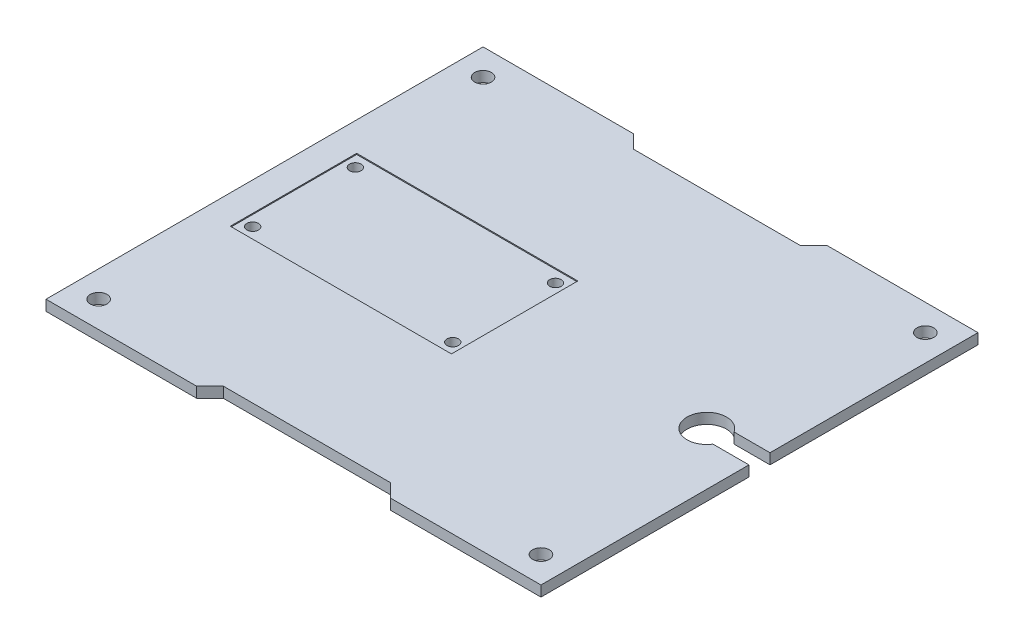
ISO-10303-21;
HEADER;
FILE_DESCRIPTION(('STEP AP214'),'2;1');
FILE_NAME('part.step','',(''),(''),'','','');
FILE_SCHEMA(('AUTOMOTIVE_DESIGN { 1 0 10303 214 1 1 1 1 }'));
ENDSEC;
DATA;
#1=APPLICATION_CONTEXT('core data for automotive mechanical design processes');
#2=APPLICATION_PROTOCOL_DEFINITION('international standard','automotive_design',2000,#1);
#3=PRODUCT_CONTEXT('',#1,'mechanical');
#4=PRODUCT('Part','Part','',(#3));
#5=PRODUCT_RELATED_PRODUCT_CATEGORY('part','',(#4));
#6=PRODUCT_DEFINITION_FORMATION('','',#4);
#7=PRODUCT_DEFINITION_CONTEXT('part definition',#1,'design');
#8=PRODUCT_DEFINITION('design','',#6,#7);
#9=PRODUCT_DEFINITION_SHAPE('','',#8);
#10=(LENGTH_UNIT() NAMED_UNIT(*) SI_UNIT(.MILLI.,.METRE.));
#11=(NAMED_UNIT(*) PLANE_ANGLE_UNIT() SI_UNIT($,.RADIAN.));
#12=(NAMED_UNIT(*) SI_UNIT($,.STERADIAN.) SOLID_ANGLE_UNIT());
#13=UNCERTAINTY_MEASURE_WITH_UNIT(LENGTH_MEASURE(1.E-05),#10,'distance_accuracy_value','');
#14=(GEOMETRIC_REPRESENTATION_CONTEXT(3) GLOBAL_UNCERTAINTY_ASSIGNED_CONTEXT((#13)) GLOBAL_UNIT_ASSIGNED_CONTEXT((#10,
#11,#12)) REPRESENTATION_CONTEXT('',''));
#15=CARTESIAN_POINT('',(0.,0.,0.));
#16=DIRECTION('',(0.,0.,1.));
#17=DIRECTION('',(1.,0.,0.));
#18=AXIS2_PLACEMENT_3D('',#15,#16,#17);
#19=CARTESIAN_POINT('',(-39.5,-8.,-9.74999999999999));
#20=DIRECTION('',(0.,1.,0.));
#21=DIRECTION('',(0.,0.,1.));
#22=AXIS2_PLACEMENT_3D('',#19,#20,#21);
#23=CYLINDRICAL_SURFACE('',#22,1.1);
#24=CARTESIAN_POINT('',(-39.5,0.,-9.74999999999999));
#25=DIRECTION('',(0.,-1.,0.));
#26=DIRECTION('',(0.,0.,-1.));
#27=AXIS2_PLACEMENT_3D('',#24,#25,#26);
#28=CIRCLE('',#27,1.1);
#29=CARTESIAN_POINT('',(-39.5,0.,-10.85));
#30=VERTEX_POINT('',#29);
#31=EDGE_CURVE('E310',#30,#30,#28,.T.);
#32=ORIENTED_EDGE('',*,*,#31,.T.);
#33=EDGE_LOOP('',(#32));
#34=FACE_BOUND('',#33,.T.);
#35=CARTESIAN_POINT('',(-39.5,1.8,-9.74999999999999));
#36=DIRECTION('',(0.,1.,0.));
#37=DIRECTION('',(0.,0.,1.));
#38=AXIS2_PLACEMENT_3D('',#35,#36,#37);
#39=CIRCLE('',#38,1.1);
#40=CARTESIAN_POINT('',(-39.5,1.8,-8.65));
#41=VERTEX_POINT('',#40);
#42=EDGE_CURVE('E238',#41,#41,#39,.F.);
#43=ORIENTED_EDGE('',*,*,#42,.F.);
#44=EDGE_LOOP('',(#43));
#45=FACE_BOUND('',#44,.T.);
#46=ADVANCED_FACE('F41',(#34,#45),#23,.F.);
#47=CARTESIAN_POINT('',(-1.5,-8.,-9.74999999999999));
#48=DIRECTION('',(0.,1.,0.));
#49=DIRECTION('',(0.,0.,1.));
#50=AXIS2_PLACEMENT_3D('',#47,#48,#49);
#51=CYLINDRICAL_SURFACE('',#50,1.1);
#52=CARTESIAN_POINT('',(-1.5,0.,-9.74999999999999));
#53=DIRECTION('',(0.,-1.,0.));
#54=DIRECTION('',(0.,0.,-1.));
#55=AXIS2_PLACEMENT_3D('',#52,#53,#54);
#56=CIRCLE('',#55,1.1);
#57=CARTESIAN_POINT('',(-1.5,0.,-10.85));
#58=VERTEX_POINT('',#57);
#59=EDGE_CURVE('E423',#58,#58,#56,.T.);
#60=ORIENTED_EDGE('',*,*,#59,.T.);
#61=EDGE_LOOP('',(#60));
#62=FACE_BOUND('',#61,.T.);
#63=CARTESIAN_POINT('',(-1.5,1.8,-9.74999999999999));
#64=DIRECTION('',(0.,1.,0.));
#65=DIRECTION('',(0.,0.,1.));
#66=AXIS2_PLACEMENT_3D('',#63,#64,#65);
#67=CIRCLE('',#66,1.1);
#68=CARTESIAN_POINT('',(-1.5,1.8,-8.65));
#69=VERTEX_POINT('',#68);
#70=EDGE_CURVE('E234',#69,#69,#67,.F.);
#71=ORIENTED_EDGE('',*,*,#70,.F.);
#72=EDGE_LOOP('',(#71));
#73=FACE_BOUND('',#72,.T.);
#74=ADVANCED_FACE('F480',(#62,#73),#51,.F.);
#75=CARTESIAN_POINT('',(-1.5,-8.,9.75000000000001));
#76=DIRECTION('',(0.,1.,0.));
#77=DIRECTION('',(0.,0.,1.));
#78=AXIS2_PLACEMENT_3D('',#75,#76,#77);
#79=CYLINDRICAL_SURFACE('',#78,1.1);
#80=CARTESIAN_POINT('',(-1.5,0.,9.75000000000001));
#81=DIRECTION('',(0.,-1.,0.));
#82=DIRECTION('',(0.,0.,-1.));
#83=AXIS2_PLACEMENT_3D('',#80,#81,#82);
#84=CIRCLE('',#83,1.1);
#85=CARTESIAN_POINT('',(-1.5,0.,8.65000000000001));
#86=VERTEX_POINT('',#85);
#87=EDGE_CURVE('E431',#86,#86,#84,.T.);
#88=ORIENTED_EDGE('',*,*,#87,.T.);
#89=EDGE_LOOP('',(#88));
#90=FACE_BOUND('',#89,.T.);
#91=CARTESIAN_POINT('',(-1.5,1.8,9.75000000000001));
#92=DIRECTION('',(0.,1.,0.));
#93=DIRECTION('',(0.,0.,1.));
#94=AXIS2_PLACEMENT_3D('',#91,#92,#93);
#95=CIRCLE('',#94,1.1);
#96=CARTESIAN_POINT('',(-1.5,1.8,10.85));
#97=VERTEX_POINT('',#96);
#98=EDGE_CURVE('E230',#97,#97,#95,.F.);
#99=ORIENTED_EDGE('',*,*,#98,.F.);
#100=EDGE_LOOP('',(#99));
#101=FACE_BOUND('',#100,.T.);
#102=ADVANCED_FACE('F485',(#90,#101),#79,.F.);
#103=CARTESIAN_POINT('',(-39.5,-8.,9.75000000000001));
#104=DIRECTION('',(0.,1.,0.));
#105=DIRECTION('',(0.,0.,1.));
#106=AXIS2_PLACEMENT_3D('',#103,#104,#105);
#107=CYLINDRICAL_SURFACE('',#106,1.1);
#108=CARTESIAN_POINT('',(-39.5,0.,9.75000000000001));
#109=DIRECTION('',(0.,-1.,0.));
#110=DIRECTION('',(0.,0.,-1.));
#111=AXIS2_PLACEMENT_3D('',#108,#109,#110);
#112=CIRCLE('',#111,1.1);
#113=CARTESIAN_POINT('',(-39.5,0.,8.65000000000001));
#114=VERTEX_POINT('',#113);
#115=EDGE_CURVE('E320',#114,#114,#112,.T.);
#116=ORIENTED_EDGE('',*,*,#115,.T.);
#117=EDGE_LOOP('',(#116));
#118=FACE_BOUND('',#117,.T.);
#119=CARTESIAN_POINT('',(-39.5,1.8,9.75000000000001));
#120=DIRECTION('',(0.,1.,0.));
#121=DIRECTION('',(0.,0.,1.));
#122=AXIS2_PLACEMENT_3D('',#119,#120,#121);
#123=CIRCLE('',#122,1.1);
#124=CARTESIAN_POINT('',(-39.5,1.8,10.85));
#125=VERTEX_POINT('',#124);
#126=EDGE_CURVE('E45',#125,#125,#123,.F.);
#127=ORIENTED_EDGE('',*,*,#126,.F.);
#128=EDGE_LOOP('',(#127));
#129=FACE_BOUND('',#128,.T.);
#130=ADVANCED_FACE('F439',(#118,#129),#107,.F.);
#131=CARTESIAN_POINT('',(47.,2.,41.5));
#132=DIRECTION('',(-1.,0.,0.));
#133=DIRECTION('',(0.,0.,1.));
#134=AXIS2_PLACEMENT_3D('',#131,#132,#133);
#135=PLANE('',#134);
#136=DIRECTION('',(0.,0.,-1.));
#137=VECTOR('',#136,1.);
#138=CARTESIAN_POINT('',(47.,2.,41.5));
#139=LINE('',#138,#137);
#140=CARTESIAN_POINT('',(47.,2.,-2.));
#141=VERTEX_POINT('',#140);
#142=CARTESIAN_POINT('',(47.,2.,-41.5));
#143=VERTEX_POINT('',#142);
#144=EDGE_CURVE('E350',#141,#143,#139,.T.);
#145=ORIENTED_EDGE('',*,*,#144,.F.);
#146=DIRECTION('',(0.,-1.,0.));
#147=VECTOR('',#146,1.);
#148=CARTESIAN_POINT('',(47.,2.,-1.99999999999999));
#149=LINE('',#148,#147);
#150=CARTESIAN_POINT('',(47.,0.,-2.));
#151=VERTEX_POINT('',#150);
#152=EDGE_CURVE('E415',#141,#151,#149,.T.);
#153=ORIENTED_EDGE('',*,*,#152,.T.);
#154=DIRECTION('',(0.,0.,-1.));
#155=VECTOR('',#154,1.);
#156=CARTESIAN_POINT('',(47.,0.,41.5));
#157=LINE('',#156,#155);
#158=CARTESIAN_POINT('',(47.,0.,-41.5));
#159=VERTEX_POINT('',#158);
#160=EDGE_CURVE('E341',#151,#159,#157,.T.);
#161=ORIENTED_EDGE('',*,*,#160,.T.);
#162=DIRECTION('',(0.,-1.,0.));
#163=VECTOR('',#162,1.);
#164=CARTESIAN_POINT('',(47.,2.,-41.5));
#165=LINE('',#164,#163);
#166=EDGE_CURVE('E392',#143,#159,#165,.T.);
#167=ORIENTED_EDGE('',*,*,#166,.F.);
#168=EDGE_LOOP('',(#145,#153,#161,#167));
#169=FACE_BOUND('',#168,.T.);
#170=ADVANCED_FACE('F507',(#169),#135,.F.);
#171=CARTESIAN_POINT('',(-47.,2.,-41.5));
#172=DIRECTION('',(0.,0.,1.));
#173=DIRECTION('',(1.,0.,0.));
#174=AXIS2_PLACEMENT_3D('',#171,#172,#173);
#175=PLANE('',#174);
#176=DIRECTION('',(-1.,0.,0.));
#177=VECTOR('',#176,1.);
#178=CARTESIAN_POINT('',(-47.,0.,-41.5));
#179=LINE('',#178,#177);
#180=CARTESIAN_POINT('',(18.415,0.,-41.5));
#181=VERTEX_POINT('',#180);
#182=EDGE_CURVE('E369',#159,#181,#179,.T.);
#183=ORIENTED_EDGE('',*,*,#182,.T.);
#184=DIRECTION('',(0.,1.,0.));
#185=VECTOR('',#184,1.);
#186=CARTESIAN_POINT('',(18.415,2.,-41.5));
#187=LINE('',#186,#185);
#188=CARTESIAN_POINT('',(18.415,2.,-41.5));
#189=VERTEX_POINT('',#188);
#190=EDGE_CURVE('E408',#181,#189,#187,.T.);
#191=ORIENTED_EDGE('',*,*,#190,.T.);
#192=DIRECTION('',(-1.,0.,0.));
#193=VECTOR('',#192,1.);
#194=CARTESIAN_POINT('',(-47.,2.,-41.5));
#195=LINE('',#194,#193);
#196=EDGE_CURVE('E351',#143,#189,#195,.T.);
#197=ORIENTED_EDGE('',*,*,#196,.F.);
#198=ORIENTED_EDGE('',*,*,#166,.T.);
#199=EDGE_LOOP('',(#183,#191,#197,#198));
#200=FACE_BOUND('',#199,.T.);
#201=ADVANCED_FACE('F642',(#200),#175,.F.);
#202=CARTESIAN_POINT('',(-47.,2.,41.5));
#203=DIRECTION('',(0.,0.,-1.));
#204=DIRECTION('',(-1.,0.,0.));
#205=AXIS2_PLACEMENT_3D('',#202,#203,#204);
#206=PLANE('',#205);
#207=DIRECTION('',(1.,0.,0.));
#208=VECTOR('',#207,1.);
#209=CARTESIAN_POINT('',(-47.,0.,41.5));
#210=LINE('',#209,#208);
#211=CARTESIAN_POINT('',(-47.,0.,41.5));
#212=VERTEX_POINT('',#211);
#213=CARTESIAN_POINT('',(-18.415,0.,41.5));
#214=VERTEX_POINT('',#213);
#215=EDGE_CURVE('E377',#212,#214,#210,.T.);
#216=ORIENTED_EDGE('',*,*,#215,.T.);
#217=DIRECTION('',(0.,1.,0.));
#218=VECTOR('',#217,1.);
#219=CARTESIAN_POINT('',(-18.415,2.,41.5));
#220=LINE('',#219,#218);
#221=CARTESIAN_POINT('',(-18.415,2.,41.5));
#222=VERTEX_POINT('',#221);
#223=EDGE_CURVE('E400',#214,#222,#220,.T.);
#224=ORIENTED_EDGE('',*,*,#223,.T.);
#225=DIRECTION('',(1.,0.,0.));
#226=VECTOR('',#225,1.);
#227=CARTESIAN_POINT('',(-47.,2.,41.5));
#228=LINE('',#227,#226);
#229=CARTESIAN_POINT('',(-47.,2.,41.5));
#230=VERTEX_POINT('',#229);
#231=EDGE_CURVE('E359',#230,#222,#228,.T.);
#232=ORIENTED_EDGE('',*,*,#231,.F.);
#233=DIRECTION('',(0.,-1.,0.));
#234=VECTOR('',#233,1.);
#235=CARTESIAN_POINT('',(-47.,2.,41.5));
#236=LINE('',#235,#234);
#237=EDGE_CURVE('E384',#230,#212,#236,.T.);
#238=ORIENTED_EDGE('',*,*,#237,.T.);
#239=EDGE_LOOP('',(#216,#224,#232,#238));
#240=FACE_BOUND('',#239,.T.);
#241=ADVANCED_FACE('F650',(#240),#206,.F.);
#242=CARTESIAN_POINT('',(0.,2.,0.));
#243=DIRECTION('',(0.,-1.,0.));
#244=DIRECTION('',(0.,0.,-1.));
#245=AXIS2_PLACEMENT_3D('',#242,#243,#244);
#246=PLANE('',#245);
#247=DIRECTION('',(1.,0.,0.));
#248=VECTOR('',#247,1.);
#249=CARTESIAN_POINT('',(-41.5,2.,12.));
#250=LINE('',#249,#248);
#251=CARTESIAN_POINT('',(-41.5,2.,12.));
#252=VERTEX_POINT('',#251);
#253=CARTESIAN_POINT('',(0.499999999999997,2.,12.));
#254=VERTEX_POINT('',#253);
#255=EDGE_CURVE('E216',#252,#254,#250,.T.);
#256=ORIENTED_EDGE('',*,*,#255,.F.);
#257=DIRECTION('',(0.,0.,1.));
#258=VECTOR('',#257,1.);
#259=CARTESIAN_POINT('',(-41.5,2.,-12.));
#260=LINE('',#259,#258);
#261=CARTESIAN_POINT('',(-41.5,2.,-12.));
#262=VERTEX_POINT('',#261);
#263=EDGE_CURVE('E58',#262,#252,#260,.T.);
#264=ORIENTED_EDGE('',*,*,#263,.F.);
#265=DIRECTION('',(-1.,0.,0.));
#266=VECTOR('',#265,1.);
#267=CARTESIAN_POINT('',(-41.5,2.,-12.));
#268=LINE('',#267,#266);
#269=CARTESIAN_POINT('',(0.499999999999997,2.,-12.));
#270=VERTEX_POINT('',#269);
#271=EDGE_CURVE('E203',#270,#262,#268,.T.);
#272=ORIENTED_EDGE('',*,*,#271,.F.);
#273=DIRECTION('',(0.,0.,-1.));
#274=VECTOR('',#273,1.);
#275=CARTESIAN_POINT('',(0.499999999999997,2.,-12.));
#276=LINE('',#275,#274);
#277=EDGE_CURVE('E207',#254,#270,#276,.T.);
#278=ORIENTED_EDGE('',*,*,#277,.F.);
#279=EDGE_LOOP('',(#256,#264,#272,#278));
#280=FACE_BOUND('',#279,.T.);
#281=CARTESIAN_POINT('',(37.,2.,0.));
#282=DIRECTION('',(0.,1.,0.));
#283=DIRECTION('',(0.,0.,1.));
#284=AXIS2_PLACEMENT_3D('',#281,#282,#283);
#285=CIRCLE('',#284,3.75);
#286=CARTESIAN_POINT('',(40.1721443851124,2.,-2.));
#287=VERTEX_POINT('',#286);
#288=CARTESIAN_POINT('',(40.1721443851124,2.,2.));
#289=VERTEX_POINT('',#288);
#290=EDGE_CURVE('E259',#287,#289,#285,.T.);
#291=ORIENTED_EDGE('',*,*,#290,.F.);
#292=DIRECTION('',(-1.,0.,0.));
#293=VECTOR('',#292,1.);
#294=CARTESIAN_POINT('',(40.1721443851124,2.,-2.));
#295=LINE('',#294,#293);
#296=EDGE_CURVE('E282',#141,#287,#295,.T.);
#297=ORIENTED_EDGE('',*,*,#296,.F.);
#298=ORIENTED_EDGE('',*,*,#144,.T.);
#299=ORIENTED_EDGE('',*,*,#196,.T.);
#300=DIRECTION('',(0.707106781186549,0.,-0.707106781186546));
#301=VECTOR('',#300,1.);
#302=CARTESIAN_POINT('',(15.875,2.,-38.96));
#303=LINE('',#302,#301);
#304=CARTESIAN_POINT('',(15.875,2.,-38.96));
#305=VERTEX_POINT('',#304);
#306=EDGE_CURVE('E252',#305,#189,#303,.T.);
#307=ORIENTED_EDGE('',*,*,#306,.F.);
#308=DIRECTION('',(1.,0.,0.));
#309=VECTOR('',#308,1.);
#310=CARTESIAN_POINT('',(-15.875,2.,-38.96));
#311=LINE('',#310,#309);
#312=CARTESIAN_POINT('',(-15.875,2.,-38.96));
#313=VERTEX_POINT('',#312);
#314=EDGE_CURVE('E247',#313,#305,#311,.T.);
#315=ORIENTED_EDGE('',*,*,#314,.F.);
#316=DIRECTION('',(0.70710678118655,0.,0.707106781186545));
#317=VECTOR('',#316,1.);
#318=CARTESIAN_POINT('',(-18.415,2.,-41.5));
#319=LINE('',#318,#317);
#320=CARTESIAN_POINT('',(-18.415,2.,-41.5));
#321=VERTEX_POINT('',#320);
#322=EDGE_CURVE('E243',#321,#313,#319,.T.);
#323=ORIENTED_EDGE('',*,*,#322,.F.);
#324=CARTESIAN_POINT('',(-47.,2.,-41.5));
#325=VERTEX_POINT('',#324);
#326=EDGE_CURVE('E349',#321,#325,#195,.T.);
#327=ORIENTED_EDGE('',*,*,#326,.T.);
#328=DIRECTION('',(0.,0.,1.));
#329=VECTOR('',#328,1.);
#330=CARTESIAN_POINT('',(-47.,2.,41.5));
#331=LINE('',#330,#329);
#332=EDGE_CURVE('E355',#325,#230,#331,.T.);
#333=ORIENTED_EDGE('',*,*,#332,.T.);
#334=ORIENTED_EDGE('',*,*,#231,.T.);
#335=DIRECTION('',(-0.707106781186548,0.,0.707106781186548));
#336=VECTOR('',#335,1.);
#337=CARTESIAN_POINT('',(-18.415,2.,41.5));
#338=LINE('',#337,#336);
#339=CARTESIAN_POINT('',(-15.875,2.,38.96));
#340=VERTEX_POINT('',#339);
#341=EDGE_CURVE('E269',#340,#222,#338,.T.);
#342=ORIENTED_EDGE('',*,*,#341,.F.);
#343=DIRECTION('',(-1.,0.,0.));
#344=VECTOR('',#343,1.);
#345=CARTESIAN_POINT('',(-15.875,2.,38.96));
#346=LINE('',#345,#344);
#347=CARTESIAN_POINT('',(15.875,2.,38.96));
#348=VERTEX_POINT('',#347);
#349=EDGE_CURVE('E265',#348,#340,#346,.T.);
#350=ORIENTED_EDGE('',*,*,#349,.F.);
#351=DIRECTION('',(-0.707106781186548,0.,-0.707106781186548));
#352=VECTOR('',#351,1.);
#353=CARTESIAN_POINT('',(15.875,2.,38.96));
#354=LINE('',#353,#352);
#355=CARTESIAN_POINT('',(18.415,2.,41.5));
#356=VERTEX_POINT('',#355);
#357=EDGE_CURVE('E242',#356,#348,#354,.T.);
#358=ORIENTED_EDGE('',*,*,#357,.F.);
#359=CARTESIAN_POINT('',(47.,2.,41.5));
#360=VERTEX_POINT('',#359);
#361=EDGE_CURVE('E358',#356,#360,#228,.T.);
#362=ORIENTED_EDGE('',*,*,#361,.T.);
#363=CARTESIAN_POINT('',(47.,2.,2.));
#364=VERTEX_POINT('',#363);
#365=EDGE_CURVE('E345',#360,#364,#139,.T.);
#366=ORIENTED_EDGE('',*,*,#365,.T.);
#367=DIRECTION('',(1.,0.,0.));
#368=VECTOR('',#367,1.);
#369=CARTESIAN_POINT('',(40.1721443851124,2.,2.));
#370=LINE('',#369,#368);
#371=EDGE_CURVE('E66',#289,#364,#370,.T.);
#372=ORIENTED_EDGE('',*,*,#371,.F.);
#373=EDGE_LOOP('',(#291,#297,#298,#299,#307,#315,#323,#327,#333,#334,#342,#350,#358,#362,#366,#372));
#374=FACE_BOUND('',#373,.T.);
#375=CARTESIAN_POINT('',(-42.,2.,-36.5));
#376=DIRECTION('',(0.,1.,0.));
#377=DIRECTION('',(0.,0.,1.));
#378=AXIS2_PLACEMENT_3D('',#375,#376,#377);
#379=CIRCLE('',#378,1.5875);
#380=CARTESIAN_POINT('',(-42.,2.,-34.9125));
#381=VERTEX_POINT('',#380);
#382=EDGE_CURVE('E337',#381,#381,#379,.T.);
#383=ORIENTED_EDGE('',*,*,#382,.F.);
#384=EDGE_LOOP('',(#383));
#385=FACE_BOUND('',#384,.T.);
#386=CARTESIAN_POINT('',(42.,2.,-36.5));
#387=DIRECTION('',(0.,1.,0.));
#388=DIRECTION('',(0.,0.,1.));
#389=AXIS2_PLACEMENT_3D('',#386,#387,#388);
#390=CIRCLE('',#389,1.5875);
#391=CARTESIAN_POINT('',(42.,2.,-34.9125));
#392=VERTEX_POINT('',#391);
#393=EDGE_CURVE('E329',#392,#392,#390,.T.);
#394=ORIENTED_EDGE('',*,*,#393,.F.);
#395=EDGE_LOOP('',(#394));
#396=FACE_BOUND('',#395,.T.);
#397=CARTESIAN_POINT('',(42.,2.,36.5));
#398=DIRECTION('',(0.,1.,0.));
#399=DIRECTION('',(0.,0.,1.));
#400=AXIS2_PLACEMENT_3D('',#397,#398,#399);
#401=CIRCLE('',#400,1.5875);
#402=CARTESIAN_POINT('',(42.,2.,38.0875));
#403=VERTEX_POINT('',#402);
#404=EDGE_CURVE('E321',#403,#403,#401,.T.);
#405=ORIENTED_EDGE('',*,*,#404,.F.);
#406=EDGE_LOOP('',(#405));
#407=FACE_BOUND('',#406,.T.);
#408=CARTESIAN_POINT('',(-42.,2.,36.5));
#409=DIRECTION('',(0.,1.,0.));
#410=DIRECTION('',(0.,0.,1.));
#411=AXIS2_PLACEMENT_3D('',#408,#409,#410);
#412=CIRCLE('',#411,1.5875);
#413=CARTESIAN_POINT('',(-42.,2.,38.0875));
#414=VERTEX_POINT('',#413);
#415=EDGE_CURVE('E311',#414,#414,#412,.T.);
#416=ORIENTED_EDGE('',*,*,#415,.F.);
#417=EDGE_LOOP('',(#416));
#418=FACE_BOUND('',#417,.T.);
#419=ADVANCED_FACE('F445',(#280,#374,#385,#396,#407,#418),#246,.F.);
#420=CARTESIAN_POINT('',(0.,0.,0.));
#421=DIRECTION('',(0.,-1.,0.));
#422=DIRECTION('',(0.,0.,-1.));
#423=AXIS2_PLACEMENT_3D('',#420,#421,#422);
#424=PLANE('',#423);
#425=DIRECTION('',(1.,0.,0.));
#426=VECTOR('',#425,1.);
#427=CARTESIAN_POINT('',(0.,0.,-2.));
#428=LINE('',#427,#426);
#429=CARTESIAN_POINT('',(40.1721443851124,0.,-2.));
#430=VERTEX_POINT('',#429);
#431=EDGE_CURVE('E307',#430,#151,#428,.T.);
#432=ORIENTED_EDGE('',*,*,#431,.F.);
#433=CARTESIAN_POINT('',(37.,0.,0.));
#434=DIRECTION('',(0.,-1.,0.));
#435=DIRECTION('',(0.,0.,-1.));
#436=AXIS2_PLACEMENT_3D('',#433,#434,#435);
#437=CIRCLE('',#436,3.75);
#438=CARTESIAN_POINT('',(40.1721443851124,0.,2.));
#439=VERTEX_POINT('',#438);
#440=EDGE_CURVE('E11',#439,#430,#437,.T.);
#441=ORIENTED_EDGE('',*,*,#440,.F.);
#442=DIRECTION('',(-1.,0.,0.));
#443=VECTOR('',#442,1.);
#444=CARTESIAN_POINT('',(0.,0.,2.00000000000001));
#445=LINE('',#444,#443);
#446=CARTESIAN_POINT('',(47.,0.,2.));
#447=VERTEX_POINT('',#446);
#448=EDGE_CURVE('E304',#447,#439,#445,.T.);
#449=ORIENTED_EDGE('',*,*,#448,.F.);
#450=CARTESIAN_POINT('',(47.,0.,41.5));
#451=VERTEX_POINT('',#450);
#452=EDGE_CURVE('E364',#451,#447,#157,.T.);
#453=ORIENTED_EDGE('',*,*,#452,.F.);
#454=CARTESIAN_POINT('',(18.415,0.,41.5));
#455=VERTEX_POINT('',#454);
#456=EDGE_CURVE('E376',#455,#451,#210,.T.);
#457=ORIENTED_EDGE('',*,*,#456,.F.);
#458=DIRECTION('',(0.707106781186548,0.,0.707106781186548));
#459=VECTOR('',#458,1.);
#460=CARTESIAN_POINT('',(-11.5425,0.,11.5425));
#461=LINE('',#460,#459);
#462=CARTESIAN_POINT('',(15.875,0.,38.96));
#463=VERTEX_POINT('',#462);
#464=EDGE_CURVE('E290',#463,#455,#461,.T.);
#465=ORIENTED_EDGE('',*,*,#464,.F.);
#466=DIRECTION('',(1.,0.,0.));
#467=VECTOR('',#466,1.);
#468=CARTESIAN_POINT('',(0.,0.,38.96));
#469=LINE('',#468,#467);
#470=CARTESIAN_POINT('',(-15.875,0.,38.96));
#471=VERTEX_POINT('',#470);
#472=EDGE_CURVE('E419',#471,#463,#469,.T.);
#473=ORIENTED_EDGE('',*,*,#472,.F.);
#474=DIRECTION('',(0.707106781186548,0.,-0.707106781186548));
#475=VECTOR('',#474,1.);
#476=CARTESIAN_POINT('',(11.5425,0.,11.5425));
#477=LINE('',#476,#475);
#478=EDGE_CURVE('E295',#214,#471,#477,.T.);
#479=ORIENTED_EDGE('',*,*,#478,.F.);
#480=ORIENTED_EDGE('',*,*,#215,.F.);
#481=DIRECTION('',(0.,0.,1.));
#482=VECTOR('',#481,1.);
#483=CARTESIAN_POINT('',(-47.,0.,41.5));
#484=LINE('',#483,#482);
#485=CARTESIAN_POINT('',(-47.,0.,-41.5));
#486=VERTEX_POINT('',#485);
#487=EDGE_CURVE('E373',#486,#212,#484,.T.);
#488=ORIENTED_EDGE('',*,*,#487,.F.);
#489=CARTESIAN_POINT('',(-18.415,0.,-41.5));
#490=VERTEX_POINT('',#489);
#491=EDGE_CURVE('E368',#490,#486,#179,.T.);
#492=ORIENTED_EDGE('',*,*,#491,.F.);
#493=DIRECTION('',(-0.70710678118655,0.,-0.707106781186545));
#494=VECTOR('',#493,1.);
#495=CARTESIAN_POINT('',(11.5425000000001,0.,-11.5425000000001));
#496=LINE('',#495,#494);
#497=CARTESIAN_POINT('',(-15.875,0.,-38.96));
#498=VERTEX_POINT('',#497);
#499=EDGE_CURVE('E298',#498,#490,#496,.T.);
#500=ORIENTED_EDGE('',*,*,#499,.F.);
#501=DIRECTION('',(-1.,0.,0.));
#502=VECTOR('',#501,1.);
#503=CARTESIAN_POINT('',(0.,0.,-38.96));
#504=LINE('',#503,#502);
#505=CARTESIAN_POINT('',(15.875,0.,-38.96));
#506=VERTEX_POINT('',#505);
#507=EDGE_CURVE('E51',#506,#498,#504,.T.);
#508=ORIENTED_EDGE('',*,*,#507,.F.);
#509=DIRECTION('',(-0.707106781186549,0.,0.707106781186546));
#510=VECTOR('',#509,1.);
#511=CARTESIAN_POINT('',(-11.5425,0.,-11.5425000000001));
#512=LINE('',#511,#510);
#513=EDGE_CURVE('E301',#181,#506,#512,.T.);
#514=ORIENTED_EDGE('',*,*,#513,.F.);
#515=ORIENTED_EDGE('',*,*,#182,.F.);
#516=ORIENTED_EDGE('',*,*,#160,.F.);
#517=EDGE_LOOP('',(#432,#441,#449,#453,#457,#465,#473,#479,#480,#488,#492,#500,#508,#514,#515,#516));
#518=FACE_BOUND('',#517,.T.);
#519=ORIENTED_EDGE('',*,*,#115,.F.);
#520=EDGE_LOOP('',(#519));
#521=FACE_BOUND('',#520,.T.);
#522=ORIENTED_EDGE('',*,*,#87,.F.);
#523=EDGE_LOOP('',(#522));
#524=FACE_BOUND('',#523,.T.);
#525=ORIENTED_EDGE('',*,*,#59,.F.);
#526=EDGE_LOOP('',(#525));
#527=FACE_BOUND('',#526,.T.);
#528=ORIENTED_EDGE('',*,*,#31,.F.);
#529=EDGE_LOOP('',(#528));
#530=FACE_BOUND('',#529,.T.);
#531=CARTESIAN_POINT('',(42.,0.,36.5));
#532=DIRECTION('',(0.,1.,0.));
#533=DIRECTION('',(0.,0.,1.));
#534=AXIS2_PLACEMENT_3D('',#531,#532,#533);
#535=CIRCLE('',#534,1.5875);
#536=CARTESIAN_POINT('',(42.,0.,38.0875));
#537=VERTEX_POINT('',#536);
#538=EDGE_CURVE('E315',#537,#537,#535,.T.);
#539=ORIENTED_EDGE('',*,*,#538,.T.);
#540=EDGE_LOOP('',(#539));
#541=FACE_BOUND('',#540,.T.);
#542=CARTESIAN_POINT('',(-42.,0.,-36.5));
#543=DIRECTION('',(0.,1.,0.));
#544=DIRECTION('',(0.,0.,1.));
#545=AXIS2_PLACEMENT_3D('',#542,#543,#544);
#546=CIRCLE('',#545,1.5875);
#547=CARTESIAN_POINT('',(-42.,0.,-34.9125));
#548=VERTEX_POINT('',#547);
#549=EDGE_CURVE('E333',#548,#548,#546,.T.);
#550=ORIENTED_EDGE('',*,*,#549,.T.);
#551=EDGE_LOOP('',(#550));
#552=FACE_BOUND('',#551,.T.);
#553=CARTESIAN_POINT('',(42.,0.,-36.5));
#554=DIRECTION('',(0.,1.,0.));
#555=DIRECTION('',(0.,0.,1.));
#556=AXIS2_PLACEMENT_3D('',#553,#554,#555);
#557=CIRCLE('',#556,1.5875);
#558=CARTESIAN_POINT('',(42.,0.,-34.9125));
#559=VERTEX_POINT('',#558);
#560=EDGE_CURVE('E325',#559,#559,#557,.T.);
#561=ORIENTED_EDGE('',*,*,#560,.T.);
#562=EDGE_LOOP('',(#561));
#563=FACE_BOUND('',#562,.T.);
#564=CARTESIAN_POINT('',(-42.,0.,36.5));
#565=DIRECTION('',(0.,1.,0.));
#566=DIRECTION('',(0.,0.,1.));
#567=AXIS2_PLACEMENT_3D('',#564,#565,#566);
#568=CIRCLE('',#567,1.5875);
#569=CARTESIAN_POINT('',(-42.,0.,38.0875));
#570=VERTEX_POINT('',#569);
#571=EDGE_CURVE('E316',#570,#570,#568,.T.);
#572=ORIENTED_EDGE('',*,*,#571,.T.);
#573=EDGE_LOOP('',(#572));
#574=FACE_BOUND('',#573,.T.);
#575=ADVANCED_FACE('F442',(#518,#521,#524,#527,#530,#541,#552,#563,#574),#424,.T.);
#576=ORIENTED_EDGE('',*,*,#452,.T.);
#577=DIRECTION('',(0.,1.,0.));
#578=VECTOR('',#577,1.);
#579=CARTESIAN_POINT('',(47.,2.,2.));
#580=LINE('',#579,#578);
#581=EDGE_CURVE('E412',#447,#364,#580,.T.);
#582=ORIENTED_EDGE('',*,*,#581,.T.);
#583=ORIENTED_EDGE('',*,*,#365,.F.);
#584=DIRECTION('',(0.,-1.,0.));
#585=VECTOR('',#584,1.);
#586=CARTESIAN_POINT('',(47.,2.,41.5));
#587=LINE('',#586,#585);
#588=EDGE_CURVE('E363',#360,#451,#587,.T.);
#589=ORIENTED_EDGE('',*,*,#588,.T.);
#590=EDGE_LOOP('',(#576,#582,#583,#589));
#591=FACE_BOUND('',#590,.T.);
#592=ADVANCED_FACE('F43',(#591),#135,.F.);
#593=ORIENTED_EDGE('',*,*,#326,.F.);
#594=DIRECTION('',(0.,-1.,0.));
#595=VECTOR('',#594,1.);
#596=CARTESIAN_POINT('',(-18.415,2.,-41.5));
#597=LINE('',#596,#595);
#598=EDGE_CURVE('E404',#321,#490,#597,.T.);
#599=ORIENTED_EDGE('',*,*,#598,.T.);
#600=ORIENTED_EDGE('',*,*,#491,.T.);
#601=DIRECTION('',(0.,-1.,0.));
#602=VECTOR('',#601,1.);
#603=CARTESIAN_POINT('',(-47.,2.,-41.5));
#604=LINE('',#603,#602);
#605=EDGE_CURVE('E388',#325,#486,#604,.T.);
#606=ORIENTED_EDGE('',*,*,#605,.F.);
#607=EDGE_LOOP('',(#593,#599,#600,#606));
#608=FACE_BOUND('',#607,.T.);
#609=ADVANCED_FACE('F652',(#608),#175,.F.);
#610=CARTESIAN_POINT('',(-47.,2.,41.5));
#611=DIRECTION('',(1.,0.,0.));
#612=DIRECTION('',(0.,0.,-1.));
#613=AXIS2_PLACEMENT_3D('',#610,#611,#612);
#614=PLANE('',#613);
#615=ORIENTED_EDGE('',*,*,#487,.T.);
#616=ORIENTED_EDGE('',*,*,#237,.F.);
#617=ORIENTED_EDGE('',*,*,#332,.F.);
#618=ORIENTED_EDGE('',*,*,#605,.T.);
#619=EDGE_LOOP('',(#615,#616,#617,#618));
#620=FACE_BOUND('',#619,.T.);
#621=ADVANCED_FACE('F695',(#620),#614,.F.);
#622=ORIENTED_EDGE('',*,*,#361,.F.);
#623=DIRECTION('',(0.,-1.,0.));
#624=VECTOR('',#623,1.);
#625=CARTESIAN_POINT('',(18.415,2.,41.5));
#626=LINE('',#625,#624);
#627=EDGE_CURVE('E396',#356,#455,#626,.T.);
#628=ORIENTED_EDGE('',*,*,#627,.T.);
#629=ORIENTED_EDGE('',*,*,#456,.T.);
#630=ORIENTED_EDGE('',*,*,#588,.F.);
#631=EDGE_LOOP('',(#622,#628,#629,#630));
#632=FACE_BOUND('',#631,.T.);
#633=ADVANCED_FACE('F661',(#632),#206,.F.);
#634=CARTESIAN_POINT('',(-42.,2.,-36.5));
#635=DIRECTION('',(0.,-1.,0.));
#636=DIRECTION('',(0.,0.,-1.));
#637=AXIS2_PLACEMENT_3D('',#634,#635,#636);
#638=CYLINDRICAL_SURFACE('',#637,1.5875);
#639=ORIENTED_EDGE('',*,*,#382,.T.);
#640=EDGE_LOOP('',(#639));
#641=FACE_BOUND('',#640,.T.);
#642=ORIENTED_EDGE('',*,*,#549,.F.);
#643=EDGE_LOOP('',(#642));
#644=FACE_BOUND('',#643,.T.);
#645=ADVANCED_FACE('F678',(#641,#644),#638,.F.);
#646=CARTESIAN_POINT('',(42.,2.,-36.5));
#647=DIRECTION('',(0.,-1.,0.));
#648=DIRECTION('',(0.,0.,-1.));
#649=AXIS2_PLACEMENT_3D('',#646,#647,#648);
#650=CYLINDRICAL_SURFACE('',#649,1.5875);
#651=ORIENTED_EDGE('',*,*,#393,.T.);
#652=EDGE_LOOP('',(#651));
#653=FACE_BOUND('',#652,.T.);
#654=ORIENTED_EDGE('',*,*,#560,.F.);
#655=EDGE_LOOP('',(#654));
#656=FACE_BOUND('',#655,.T.);
#657=ADVANCED_FACE('F475',(#653,#656),#650,.F.);
#658=CARTESIAN_POINT('',(42.,2.,36.5));
#659=DIRECTION('',(0.,-1.,0.));
#660=DIRECTION('',(0.,0.,-1.));
#661=AXIS2_PLACEMENT_3D('',#658,#659,#660);
#662=CYLINDRICAL_SURFACE('',#661,1.5875);
#663=ORIENTED_EDGE('',*,*,#404,.T.);
#664=EDGE_LOOP('',(#663));
#665=FACE_BOUND('',#664,.T.);
#666=ORIENTED_EDGE('',*,*,#538,.F.);
#667=EDGE_LOOP('',(#666));
#668=FACE_BOUND('',#667,.T.);
#669=ADVANCED_FACE('F465',(#665,#668),#662,.F.);
#670=CARTESIAN_POINT('',(-42.,2.,36.5));
#671=DIRECTION('',(0.,-1.,0.));
#672=DIRECTION('',(0.,0.,-1.));
#673=AXIS2_PLACEMENT_3D('',#670,#671,#672);
#674=CYLINDRICAL_SURFACE('',#673,1.5875);
#675=ORIENTED_EDGE('',*,*,#415,.T.);
#676=EDGE_LOOP('',(#675));
#677=FACE_BOUND('',#676,.T.);
#678=ORIENTED_EDGE('',*,*,#571,.F.);
#679=EDGE_LOOP('',(#678));
#680=FACE_BOUND('',#679,.T.);
#681=ADVANCED_FACE('F462',(#677,#680),#674,.F.);
#682=CARTESIAN_POINT('',(-18.415,-8.,41.5));
#683=DIRECTION('',(-0.707106781186548,0.,-0.707106781186548));
#684=DIRECTION('',(-0.707106781186548,0.,0.707106781186548));
#685=AXIS2_PLACEMENT_3D('',#682,#683,#684);
#686=PLANE('',#685);
#687=ORIENTED_EDGE('',*,*,#478,.T.);
#688=DIRECTION('',(0.,1.,0.));
#689=VECTOR('',#688,1.);
#690=CARTESIAN_POINT('',(-15.875,-8.,38.96));
#691=LINE('',#690,#689);
#692=EDGE_CURVE('E248',#471,#340,#691,.T.);
#693=ORIENTED_EDGE('',*,*,#692,.T.);
#694=ORIENTED_EDGE('',*,*,#341,.T.);
#695=ORIENTED_EDGE('',*,*,#223,.F.);
#696=EDGE_LOOP('',(#687,#693,#694,#695));
#697=FACE_BOUND('',#696,.T.);
#698=ADVANCED_FACE('F464',(#697),#686,.F.);
#699=CARTESIAN_POINT('',(-15.875,-8.,38.96));
#700=DIRECTION('',(0.,0.,-1.));
#701=DIRECTION('',(-1.,0.,0.));
#702=AXIS2_PLACEMENT_3D('',#699,#700,#701);
#703=PLANE('',#702);
#704=ORIENTED_EDGE('',*,*,#472,.T.);
#705=DIRECTION('',(0.,1.,0.));
#706=VECTOR('',#705,1.);
#707=CARTESIAN_POINT('',(15.875,-8.,38.96));
#708=LINE('',#707,#706);
#709=EDGE_CURVE('E272',#463,#348,#708,.T.);
#710=ORIENTED_EDGE('',*,*,#709,.T.);
#711=ORIENTED_EDGE('',*,*,#349,.T.);
#712=ORIENTED_EDGE('',*,*,#692,.F.);
#713=EDGE_LOOP('',(#704,#710,#711,#712));
#714=FACE_BOUND('',#713,.T.);
#715=ADVANCED_FACE('F472',(#714),#703,.F.);
#716=CARTESIAN_POINT('',(15.875,-8.,38.96));
#717=DIRECTION('',(0.707106781186548,0.,-0.707106781186548));
#718=DIRECTION('',(-0.707106781186548,0.,-0.707106781186548));
#719=AXIS2_PLACEMENT_3D('',#716,#717,#718);
#720=PLANE('',#719);
#721=ORIENTED_EDGE('',*,*,#464,.T.);
#722=ORIENTED_EDGE('',*,*,#627,.F.);
#723=ORIENTED_EDGE('',*,*,#357,.T.);
#724=ORIENTED_EDGE('',*,*,#709,.F.);
#725=EDGE_LOOP('',(#721,#722,#723,#724));
#726=FACE_BOUND('',#725,.T.);
#727=ADVANCED_FACE('F508',(#726),#720,.F.);
#728=CARTESIAN_POINT('',(15.875,-8.,-38.96));
#729=DIRECTION('',(0.707106781186546,0.,0.707106781186549));
#730=DIRECTION('',(0.707106781186549,0.,-0.707106781186546));
#731=AXIS2_PLACEMENT_3D('',#728,#729,#730);
#732=PLANE('',#731);
#733=ORIENTED_EDGE('',*,*,#513,.T.);
#734=DIRECTION('',(0.,1.,0.));
#735=VECTOR('',#734,1.);
#736=CARTESIAN_POINT('',(15.875,-8.,-38.96));
#737=LINE('',#736,#735);
#738=EDGE_CURVE('E256',#506,#305,#737,.T.);
#739=ORIENTED_EDGE('',*,*,#738,.T.);
#740=ORIENTED_EDGE('',*,*,#306,.T.);
#741=ORIENTED_EDGE('',*,*,#190,.F.);
#742=EDGE_LOOP('',(#733,#739,#740,#741));
#743=FACE_BOUND('',#742,.T.);
#744=ADVANCED_FACE('F511',(#743),#732,.F.);
#745=CARTESIAN_POINT('',(-15.875,-8.,-38.96));
#746=DIRECTION('',(0.,0.,1.));
#747=DIRECTION('',(1.,0.,0.));
#748=AXIS2_PLACEMENT_3D('',#745,#746,#747);
#749=PLANE('',#748);
#750=ORIENTED_EDGE('',*,*,#507,.T.);
#751=DIRECTION('',(0.,1.,0.));
#752=VECTOR('',#751,1.);
#753=CARTESIAN_POINT('',(-15.875,-8.,-38.96));
#754=LINE('',#753,#752);
#755=EDGE_CURVE('E255',#498,#313,#754,.T.);
#756=ORIENTED_EDGE('',*,*,#755,.T.);
#757=ORIENTED_EDGE('',*,*,#314,.T.);
#758=ORIENTED_EDGE('',*,*,#738,.F.);
#759=EDGE_LOOP('',(#750,#756,#757,#758));
#760=FACE_BOUND('',#759,.T.);
#761=ADVANCED_FACE('F518',(#760),#749,.F.);
#762=CARTESIAN_POINT('',(-18.415,-8.,-41.5));
#763=DIRECTION('',(-0.707106781186545,0.,0.70710678118655));
#764=DIRECTION('',(0.70710678118655,0.,0.707106781186545));
#765=AXIS2_PLACEMENT_3D('',#762,#763,#764);
#766=PLANE('',#765);
#767=ORIENTED_EDGE('',*,*,#499,.T.);
#768=ORIENTED_EDGE('',*,*,#598,.F.);
#769=ORIENTED_EDGE('',*,*,#322,.T.);
#770=ORIENTED_EDGE('',*,*,#755,.F.);
#771=EDGE_LOOP('',(#767,#768,#769,#770));
#772=FACE_BOUND('',#771,.T.);
#773=ADVANCED_FACE('F497',(#772),#766,.F.);
#774=CARTESIAN_POINT('',(37.,-8.,0.));
#775=DIRECTION('',(0.,1.,0.));
#776=DIRECTION('',(0.,0.,1.));
#777=AXIS2_PLACEMENT_3D('',#774,#775,#776);
#778=CYLINDRICAL_SURFACE('',#777,3.75);
#779=ORIENTED_EDGE('',*,*,#440,.T.);
#780=DIRECTION('',(0.,1.,0.));
#781=VECTOR('',#780,1.);
#782=CARTESIAN_POINT('',(40.1721443851124,-8.,-2.));
#783=LINE('',#782,#781);
#784=EDGE_CURVE('E287',#430,#287,#783,.T.);
#785=ORIENTED_EDGE('',*,*,#784,.T.);
#786=ORIENTED_EDGE('',*,*,#290,.T.);
#787=DIRECTION('',(0.,1.,0.));
#788=VECTOR('',#787,1.);
#789=CARTESIAN_POINT('',(40.1721443851124,-8.,2.));
#790=LINE('',#789,#788);
#791=EDGE_CURVE('E286',#439,#289,#790,.T.);
#792=ORIENTED_EDGE('',*,*,#791,.F.);
#793=EDGE_LOOP('',(#779,#785,#786,#792));
#794=FACE_BOUND('',#793,.T.);
#795=ADVANCED_FACE('F493',(#794),#778,.F.);
#796=CARTESIAN_POINT('',(40.1721443851124,-8.,-2.));
#797=DIRECTION('',(0.,0.,-1.));
#798=DIRECTION('',(-1.,0.,0.));
#799=AXIS2_PLACEMENT_3D('',#796,#797,#798);
#800=PLANE('',#799);
#801=ORIENTED_EDGE('',*,*,#431,.T.);
#802=ORIENTED_EDGE('',*,*,#152,.F.);
#803=ORIENTED_EDGE('',*,*,#296,.T.);
#804=ORIENTED_EDGE('',*,*,#784,.F.);
#805=EDGE_LOOP('',(#801,#802,#803,#804));
#806=FACE_BOUND('',#805,.T.);
#807=ADVANCED_FACE('F496',(#806),#800,.F.);
#808=CARTESIAN_POINT('',(40.1721443851124,-8.,2.));
#809=DIRECTION('',(0.,0.,1.));
#810=DIRECTION('',(1.,0.,0.));
#811=AXIS2_PLACEMENT_3D('',#808,#809,#810);
#812=PLANE('',#811);
#813=ORIENTED_EDGE('',*,*,#448,.T.);
#814=ORIENTED_EDGE('',*,*,#791,.T.);
#815=ORIENTED_EDGE('',*,*,#371,.T.);
#816=ORIENTED_EDGE('',*,*,#581,.F.);
#817=EDGE_LOOP('',(#813,#814,#815,#816));
#818=FACE_BOUND('',#817,.T.);
#819=ADVANCED_FACE('F499',(#818),#812,.F.);
#820=CARTESIAN_POINT('',(0.,1.8,0.));
#821=DIRECTION('',(0.,1.,0.));
#822=DIRECTION('',(0.,0.,1.));
#823=AXIS2_PLACEMENT_3D('',#820,#821,#822);
#824=PLANE('',#823);
#825=DIRECTION('',(0.,0.,1.));
#826=VECTOR('',#825,1.);
#827=CARTESIAN_POINT('',(-41.5,1.8,-12.));
#828=LINE('',#827,#826);
#829=CARTESIAN_POINT('',(-41.5,1.8,-12.));
#830=VERTEX_POINT('',#829);
#831=CARTESIAN_POINT('',(-41.5,1.8,12.));
#832=VERTEX_POINT('',#831);
#833=EDGE_CURVE('E181',#830,#832,#828,.T.);
#834=ORIENTED_EDGE('',*,*,#833,.T.);
#835=DIRECTION('',(1.,0.,0.));
#836=VECTOR('',#835,1.);
#837=CARTESIAN_POINT('',(-41.5,1.8,12.));
#838=LINE('',#837,#836);
#839=CARTESIAN_POINT('',(0.499999999999997,1.8,12.));
#840=VERTEX_POINT('',#839);
#841=EDGE_CURVE('E191',#832,#840,#838,.T.);
#842=ORIENTED_EDGE('',*,*,#841,.T.);
#843=DIRECTION('',(0.,0.,-1.));
#844=VECTOR('',#843,1.);
#845=CARTESIAN_POINT('',(0.499999999999997,1.8,-12.));
#846=LINE('',#845,#844);
#847=CARTESIAN_POINT('',(0.499999999999997,1.8,-12.));
#848=VERTEX_POINT('',#847);
#849=EDGE_CURVE('E197',#840,#848,#846,.T.);
#850=ORIENTED_EDGE('',*,*,#849,.T.);
#851=DIRECTION('',(-1.,0.,0.));
#852=VECTOR('',#851,1.);
#853=CARTESIAN_POINT('',(-41.5,1.8,-12.));
#854=LINE('',#853,#852);
#855=EDGE_CURVE('E188',#848,#830,#854,.T.);
#856=ORIENTED_EDGE('',*,*,#855,.T.);
#857=EDGE_LOOP('',(#834,#842,#850,#856));
#858=FACE_BOUND('',#857,.T.);
#859=ORIENTED_EDGE('',*,*,#126,.T.);
#860=EDGE_LOOP('',(#859));
#861=FACE_BOUND('',#860,.T.);
#862=ORIENTED_EDGE('',*,*,#98,.T.);
#863=EDGE_LOOP('',(#862));
#864=FACE_BOUND('',#863,.T.);
#865=ORIENTED_EDGE('',*,*,#70,.T.);
#866=EDGE_LOOP('',(#865));
#867=FACE_BOUND('',#866,.T.);
#868=ORIENTED_EDGE('',*,*,#42,.T.);
#869=EDGE_LOOP('',(#868));
#870=FACE_BOUND('',#869,.T.);
#871=ADVANCED_FACE('F199',(#858,#861,#864,#867,#870),#824,.T.);
#872=CARTESIAN_POINT('',(-41.5,1.8,-12.));
#873=DIRECTION('',(-1.,0.,0.));
#874=DIRECTION('',(0.,0.,1.));
#875=AXIS2_PLACEMENT_3D('',#872,#873,#874);
#876=PLANE('',#875);
#877=ORIENTED_EDGE('',*,*,#263,.T.);
#878=DIRECTION('',(0.,1.,0.));
#879=VECTOR('',#878,1.);
#880=CARTESIAN_POINT('',(-41.5,1.8,12.));
#881=LINE('',#880,#879);
#882=EDGE_CURVE('E177',#832,#252,#881,.T.);
#883=ORIENTED_EDGE('',*,*,#882,.F.);
#884=ORIENTED_EDGE('',*,*,#833,.F.);
#885=DIRECTION('',(0.,1.,0.));
#886=VECTOR('',#885,1.);
#887=CARTESIAN_POINT('',(-41.5,1.8,-12.));
#888=LINE('',#887,#886);
#889=EDGE_CURVE('E222',#830,#262,#888,.T.);
#890=ORIENTED_EDGE('',*,*,#889,.T.);
#891=EDGE_LOOP('',(#877,#883,#884,#890));
#892=FACE_BOUND('',#891,.T.);
#893=ADVANCED_FACE('F179',(#892),#876,.F.);
#894=CARTESIAN_POINT('',(-41.5,1.8,-12.));
#895=DIRECTION('',(0.,0.,-1.));
#896=DIRECTION('',(-1.,0.,0.));
#897=AXIS2_PLACEMENT_3D('',#894,#895,#896);
#898=PLANE('',#897);
#899=ORIENTED_EDGE('',*,*,#271,.T.);
#900=ORIENTED_EDGE('',*,*,#889,.F.);
#901=ORIENTED_EDGE('',*,*,#855,.F.);
#902=DIRECTION('',(0.,1.,0.));
#903=VECTOR('',#902,1.);
#904=CARTESIAN_POINT('',(0.499999999999997,1.8,-12.));
#905=LINE('',#904,#903);
#906=EDGE_CURVE('E225',#848,#270,#905,.T.);
#907=ORIENTED_EDGE('',*,*,#906,.T.);
#908=EDGE_LOOP('',(#899,#900,#901,#907));
#909=FACE_BOUND('',#908,.T.);
#910=ADVANCED_FACE('F528',(#909),#898,.F.);
#911=CARTESIAN_POINT('',(0.499999999999997,1.8,-12.));
#912=DIRECTION('',(1.,0.,0.));
#913=DIRECTION('',(0.,0.,-1.));
#914=AXIS2_PLACEMENT_3D('',#911,#912,#913);
#915=PLANE('',#914);
#916=ORIENTED_EDGE('',*,*,#277,.T.);
#917=ORIENTED_EDGE('',*,*,#906,.F.);
#918=ORIENTED_EDGE('',*,*,#849,.F.);
#919=DIRECTION('',(0.,1.,0.));
#920=VECTOR('',#919,1.);
#921=CARTESIAN_POINT('',(0.499999999999997,1.8,12.));
#922=LINE('',#921,#920);
#923=EDGE_CURVE('E187',#840,#254,#922,.T.);
#924=ORIENTED_EDGE('',*,*,#923,.T.);
#925=EDGE_LOOP('',(#916,#917,#918,#924));
#926=FACE_BOUND('',#925,.T.);
#927=ADVANCED_FACE('F531',(#926),#915,.F.);
#928=CARTESIAN_POINT('',(-41.5,1.8,12.));
#929=DIRECTION('',(0.,0.,1.));
#930=DIRECTION('',(1.,0.,0.));
#931=AXIS2_PLACEMENT_3D('',#928,#929,#930);
#932=PLANE('',#931);
#933=ORIENTED_EDGE('',*,*,#255,.T.);
#934=ORIENTED_EDGE('',*,*,#923,.F.);
#935=ORIENTED_EDGE('',*,*,#841,.F.);
#936=ORIENTED_EDGE('',*,*,#882,.T.);
#937=EDGE_LOOP('',(#933,#934,#935,#936));
#938=FACE_BOUND('',#937,.T.);
#939=ADVANCED_FACE('F192',(#938),#932,.F.);
#940=CLOSED_SHELL('',(#46,#74,#102,#130,#170,#201,#241,#419,#575,#592,#609,#621,#633,#645,#657,
#669,#681,#698,#715,#727,#744,#761,#773,#795,#807,#819,#871,#893,#910,#927,#939));
#941=MANIFOLD_SOLID_BREP('B2',#940);
#942=ADVANCED_BREP_SHAPE_REPRESENTATION('',(#18,#941),#14);
#943=SHAPE_DEFINITION_REPRESENTATION(#9,#942);
ENDSEC;
END-ISO-10303-21;
